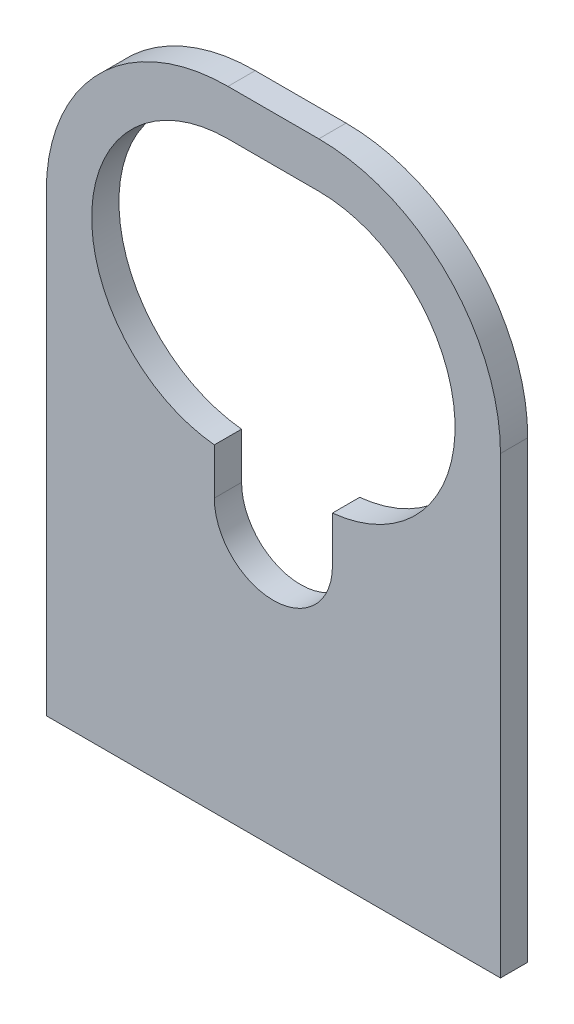
ISO-10303-21;
HEADER;
FILE_DESCRIPTION(('STEP AP214'),'2;1');
FILE_NAME('part.step','',(''),(''),'','','');
FILE_SCHEMA(('AUTOMOTIVE_DESIGN { 1 0 10303 214 1 1 1 1 }'));
ENDSEC;
DATA;
#1=APPLICATION_CONTEXT('core data for automotive mechanical design processes');
#2=APPLICATION_PROTOCOL_DEFINITION('international standard','automotive_design',2000,#1);
#3=PRODUCT_CONTEXT('',#1,'mechanical');
#4=PRODUCT('Part','Part','',(#3));
#5=PRODUCT_RELATED_PRODUCT_CATEGORY('part','',(#4));
#6=PRODUCT_DEFINITION_FORMATION('','',#4);
#7=PRODUCT_DEFINITION_CONTEXT('part definition',#1,'design');
#8=PRODUCT_DEFINITION('design','',#6,#7);
#9=PRODUCT_DEFINITION_SHAPE('','',#8);
#10=(LENGTH_UNIT() NAMED_UNIT(*) SI_UNIT(.MILLI.,.METRE.));
#11=(NAMED_UNIT(*) PLANE_ANGLE_UNIT() SI_UNIT($,.RADIAN.));
#12=(NAMED_UNIT(*) SI_UNIT($,.STERADIAN.) SOLID_ANGLE_UNIT());
#13=UNCERTAINTY_MEASURE_WITH_UNIT(LENGTH_MEASURE(1.E-05),#10,'distance_accuracy_value','');
#14=(GEOMETRIC_REPRESENTATION_CONTEXT(3) GLOBAL_UNCERTAINTY_ASSIGNED_CONTEXT((#13)) GLOBAL_UNIT_ASSIGNED_CONTEXT((#10,
#11,#12)) REPRESENTATION_CONTEXT('',''));
#15=CARTESIAN_POINT('',(0.,0.,0.));
#16=DIRECTION('',(0.,0.,1.));
#17=DIRECTION('',(1.,0.,0.));
#18=AXIS2_PLACEMENT_3D('',#15,#16,#17);
#19=CARTESIAN_POINT('',(-25.,40.,3.));
#20=DIRECTION('',(1.,0.,0.));
#21=DIRECTION('',(0.,1.,0.));
#22=AXIS2_PLACEMENT_3D('',#19,#20,#21);
#23=PLANE('',#22);
#24=DIRECTION('',(0.,-1.,0.));
#25=VECTOR('',#24,1.);
#26=CARTESIAN_POINT('',(-25.,40.,3.));
#27=LINE('',#26,#25);
#28=CARTESIAN_POINT('',(-25.,20.,3.));
#29=VERTEX_POINT('',#28);
#30=CARTESIAN_POINT('',(-25.,-30.,3.));
#31=VERTEX_POINT('',#30);
#32=EDGE_CURVE('E167',#29,#31,#27,.T.);
#33=ORIENTED_EDGE('',*,*,#32,.F.);
#34=DIRECTION('',(0.,0.,-1.));
#35=VECTOR('',#34,1.);
#36=CARTESIAN_POINT('',(-25.,20.,3.));
#37=LINE('',#36,#35);
#38=CARTESIAN_POINT('',(-25.,20.,0.));
#39=VERTEX_POINT('',#38);
#40=EDGE_CURVE('E11',#29,#39,#37,.T.);
#41=ORIENTED_EDGE('',*,*,#40,.T.);
#42=DIRECTION('',(0.,-1.,0.));
#43=VECTOR('',#42,1.);
#44=CARTESIAN_POINT('',(-25.,40.,0.));
#45=LINE('',#44,#43);
#46=CARTESIAN_POINT('',(-25.,-30.,0.));
#47=VERTEX_POINT('',#46);
#48=EDGE_CURVE('E156',#39,#47,#45,.T.);
#49=ORIENTED_EDGE('',*,*,#48,.T.);
#50=DIRECTION('',(0.,0.,-1.));
#51=VECTOR('',#50,1.);
#52=CARTESIAN_POINT('',(-25.,-30.,3.));
#53=LINE('',#52,#51);
#54=EDGE_CURVE('E212',#31,#47,#53,.T.);
#55=ORIENTED_EDGE('',*,*,#54,.F.);
#56=EDGE_LOOP('',(#33,#41,#49,#55));
#57=FACE_BOUND('',#56,.T.);
#58=ADVANCED_FACE('F35',(#57),#23,.F.);
#59=CARTESIAN_POINT('',(-25.,-30.,3.));
#60=DIRECTION('',(0.,1.,0.));
#61=DIRECTION('',(0.,0.,1.));
#62=AXIS2_PLACEMENT_3D('',#59,#60,#61);
#63=PLANE('',#62);
#64=DIRECTION('',(1.,0.,0.));
#65=VECTOR('',#64,1.);
#66=CARTESIAN_POINT('',(-25.,-30.,0.));
#67=LINE('',#66,#65);
#68=CARTESIAN_POINT('',(25.,-30.,0.));
#69=VERTEX_POINT('',#68);
#70=EDGE_CURVE('E205',#47,#69,#67,.T.);
#71=ORIENTED_EDGE('',*,*,#70,.T.);
#72=DIRECTION('',(0.,0.,-1.));
#73=VECTOR('',#72,1.);
#74=CARTESIAN_POINT('',(25.,-30.,3.));
#75=LINE('',#74,#73);
#76=CARTESIAN_POINT('',(25.,-30.,3.));
#77=VERTEX_POINT('',#76);
#78=EDGE_CURVE('E195',#77,#69,#75,.T.);
#79=ORIENTED_EDGE('',*,*,#78,.F.);
#80=DIRECTION('',(1.,0.,0.));
#81=VECTOR('',#80,1.);
#82=CARTESIAN_POINT('',(-25.,-30.,3.));
#83=LINE('',#82,#81);
#84=EDGE_CURVE('E285',#31,#77,#83,.T.);
#85=ORIENTED_EDGE('',*,*,#84,.F.);
#86=ORIENTED_EDGE('',*,*,#54,.T.);
#87=EDGE_LOOP('',(#71,#79,#85,#86));
#88=FACE_BOUND('',#87,.T.);
#89=ADVANCED_FACE('F265',(#88),#63,.F.);
#90=CARTESIAN_POINT('',(25.,40.,3.));
#91=DIRECTION('',(-1.,0.,0.));
#92=DIRECTION('',(0.,-1.,0.));
#93=AXIS2_PLACEMENT_3D('',#90,#91,#92);
#94=PLANE('',#93);
#95=DIRECTION('',(0.,1.,0.));
#96=VECTOR('',#95,1.);
#97=CARTESIAN_POINT('',(25.,40.,0.));
#98=LINE('',#97,#96);
#99=CARTESIAN_POINT('',(25.,20.,0.));
#100=VERTEX_POINT('',#99);
#101=EDGE_CURVE('E200',#69,#100,#98,.T.);
#102=ORIENTED_EDGE('',*,*,#101,.T.);
#103=DIRECTION('',(0.,0.,-1.));
#104=VECTOR('',#103,1.);
#105=CARTESIAN_POINT('',(25.,20.,3.));
#106=LINE('',#105,#104);
#107=CARTESIAN_POINT('',(25.,20.,3.));
#108=VERTEX_POINT('',#107);
#109=EDGE_CURVE('E58',#100,#108,#106,.F.);
#110=ORIENTED_EDGE('',*,*,#109,.T.);
#111=DIRECTION('',(0.,1.,0.));
#112=VECTOR('',#111,1.);
#113=CARTESIAN_POINT('',(25.,40.,3.));
#114=LINE('',#113,#112);
#115=EDGE_CURVE('E187',#77,#108,#114,.T.);
#116=ORIENTED_EDGE('',*,*,#115,.F.);
#117=ORIENTED_EDGE('',*,*,#78,.T.);
#118=EDGE_LOOP('',(#102,#110,#116,#117));
#119=FACE_BOUND('',#118,.T.);
#120=ADVANCED_FACE('F203',(#119),#94,.F.);
#121=CARTESIAN_POINT('',(-25.,40.,3.));
#122=DIRECTION('',(0.,-1.,0.));
#123=DIRECTION('',(0.,0.,-1.));
#124=AXIS2_PLACEMENT_3D('',#121,#122,#123);
#125=PLANE('',#124);
#126=DIRECTION('',(-1.,0.,0.));
#127=VECTOR('',#126,1.);
#128=CARTESIAN_POINT('',(-25.,40.,3.));
#129=LINE('',#128,#127);
#130=CARTESIAN_POINT('',(5.,40.,3.));
#131=VERTEX_POINT('',#130);
#132=CARTESIAN_POINT('',(-5.,40.,3.));
#133=VERTEX_POINT('',#132);
#134=EDGE_CURVE('E186',#131,#133,#129,.T.);
#135=ORIENTED_EDGE('',*,*,#134,.F.);
#136=DIRECTION('',(0.,0.,-1.));
#137=VECTOR('',#136,1.);
#138=CARTESIAN_POINT('',(5.,40.,3.));
#139=LINE('',#138,#137);
#140=CARTESIAN_POINT('',(5.,40.,0.));
#141=VERTEX_POINT('',#140);
#142=EDGE_CURVE('E175',#131,#141,#139,.T.);
#143=ORIENTED_EDGE('',*,*,#142,.T.);
#144=DIRECTION('',(-1.,0.,0.));
#145=VECTOR('',#144,1.);
#146=CARTESIAN_POINT('',(-25.,40.,0.));
#147=LINE('',#146,#145);
#148=CARTESIAN_POINT('',(-5.,40.,0.));
#149=VERTEX_POINT('',#148);
#150=EDGE_CURVE('E201',#141,#149,#147,.T.);
#151=ORIENTED_EDGE('',*,*,#150,.T.);
#152=DIRECTION('',(0.,0.,-1.));
#153=VECTOR('',#152,1.);
#154=CARTESIAN_POINT('',(-5.,40.,3.));
#155=LINE('',#154,#153);
#156=EDGE_CURVE('E173',#149,#133,#155,.F.);
#157=ORIENTED_EDGE('',*,*,#156,.T.);
#158=EDGE_LOOP('',(#135,#143,#151,#157));
#159=FACE_BOUND('',#158,.T.);
#160=ADVANCED_FACE('F191',(#159),#125,.F.);
#161=CARTESIAN_POINT('',(0.,0.,3.));
#162=DIRECTION('',(0.,0.,1.));
#163=DIRECTION('',(1.,0.,0.));
#164=AXIS2_PLACEMENT_3D('',#161,#162,#163);
#165=PLANE('',#164);
#166=DIRECTION('',(0.,-1.,0.));
#167=VECTOR('',#166,1.);
#168=CARTESIAN_POINT('',(-6.5,0.,3.));
#169=LINE('',#168,#167);
#170=CARTESIAN_POINT('',(-6.5,5.07518844340074,3.));
#171=VERTEX_POINT('',#170);
#172=CARTESIAN_POINT('',(-6.5,0.,3.000006));
#173=VERTEX_POINT('',#172);
#174=EDGE_CURVE('E132',#171,#173,#169,.T.);
#175=ORIENTED_EDGE('',*,*,#174,.F.);
#176=CARTESIAN_POINT('',(-5.,20.,3.));
#177=DIRECTION('',(0.,0.,1.));
#178=DIRECTION('',(1.,0.,0.));
#179=AXIS2_PLACEMENT_3D('',#176,#177,#178);
#180=CIRCLE('',#179,15.);
#181=CARTESIAN_POINT('',(-4.99999999999999,35.,3.));
#182=VERTEX_POINT('',#181);
#183=EDGE_CURVE('E154',#182,#171,#180,.T.);
#184=ORIENTED_EDGE('',*,*,#183,.F.);
#185=DIRECTION('',(1.,0.,0.));
#186=VECTOR('',#185,1.);
#187=CARTESIAN_POINT('',(-4.99999999999999,35.,3.));
#188=LINE('',#187,#186);
#189=CARTESIAN_POINT('',(5.,35.,3.));
#190=VERTEX_POINT('',#189);
#191=EDGE_CURVE('E159',#190,#182,#188,.F.);
#192=ORIENTED_EDGE('',*,*,#191,.F.);
#193=CARTESIAN_POINT('',(5.00000000000001,20.,3.));
#194=DIRECTION('',(0.,0.,1.));
#195=DIRECTION('',(1.,0.,0.));
#196=AXIS2_PLACEMENT_3D('',#193,#194,#195);
#197=CIRCLE('',#196,15.);
#198=CARTESIAN_POINT('',(6.5,5.07518844340074,3.));
#199=VERTEX_POINT('',#198);
#200=EDGE_CURVE('E216',#199,#190,#197,.T.);
#201=ORIENTED_EDGE('',*,*,#200,.F.);
#202=DIRECTION('',(0.,1.,0.));
#203=VECTOR('',#202,1.);
#204=CARTESIAN_POINT('',(6.5,0.,3.));
#205=LINE('',#204,#203);
#206=CARTESIAN_POINT('',(6.5,0.,3.000006));
#207=VERTEX_POINT('',#206);
#208=EDGE_CURVE('E229',#207,#199,#205,.T.);
#209=ORIENTED_EDGE('',*,*,#208,.F.);
#210=CARTESIAN_POINT('',(0.,0.,3.));
#211=DIRECTION('',(0.,0.,1.));
#212=DIRECTION('',(1.,0.,0.));
#213=AXIS2_PLACEMENT_3D('',#210,#211,#212);
#214=CIRCLE('',#213,6.5);
#215=EDGE_CURVE('E153',#173,#207,#214,.T.);
#216=ORIENTED_EDGE('',*,*,#215,.F.);
#217=EDGE_LOOP('',(#175,#184,#192,#201,#209,#216));
#218=FACE_BOUND('',#217,.T.);
#219=ORIENTED_EDGE('',*,*,#115,.T.);
#220=CARTESIAN_POINT('',(5.,20.,3.));
#221=DIRECTION('',(0.,0.,1.));
#222=DIRECTION('',(1.,0.,0.));
#223=AXIS2_PLACEMENT_3D('',#220,#221,#222);
#224=CIRCLE('',#223,20.);
#225=EDGE_CURVE('E43',#108,#131,#224,.T.);
#226=ORIENTED_EDGE('',*,*,#225,.T.);
#227=ORIENTED_EDGE('',*,*,#134,.T.);
#228=CARTESIAN_POINT('',(-5.00000000000001,20.,3.));
#229=DIRECTION('',(0.,0.,1.));
#230=DIRECTION('',(1.,0.,0.));
#231=AXIS2_PLACEMENT_3D('',#228,#229,#230);
#232=CIRCLE('',#231,20.);
#233=EDGE_CURVE('E50',#133,#29,#232,.T.);
#234=ORIENTED_EDGE('',*,*,#233,.T.);
#235=ORIENTED_EDGE('',*,*,#32,.T.);
#236=ORIENTED_EDGE('',*,*,#84,.T.);
#237=EDGE_LOOP('',(#219,#226,#227,#234,#235,#236));
#238=FACE_BOUND('',#237,.T.);
#239=ADVANCED_FACE('F185',(#218,#238),#165,.T.);
#240=CARTESIAN_POINT('',(0.,0.,0.));
#241=DIRECTION('',(0.,0.,1.));
#242=DIRECTION('',(1.,0.,0.));
#243=AXIS2_PLACEMENT_3D('',#240,#241,#242);
#244=PLANE('',#243);
#245=CARTESIAN_POINT('',(-5.,20.,0.));
#246=DIRECTION('',(0.,0.,1.));
#247=DIRECTION('',(1.,0.,0.));
#248=AXIS2_PLACEMENT_3D('',#245,#246,#247);
#249=CIRCLE('',#248,15.);
#250=CARTESIAN_POINT('',(-4.99999999999999,35.,0.));
#251=VERTEX_POINT('',#250);
#252=CARTESIAN_POINT('',(-6.5,5.07518844340074,0.));
#253=VERTEX_POINT('',#252);
#254=EDGE_CURVE('E149',#251,#253,#249,.T.);
#255=ORIENTED_EDGE('',*,*,#254,.T.);
#256=DIRECTION('',(0.,-1.,0.));
#257=VECTOR('',#256,1.);
#258=CARTESIAN_POINT('',(-6.5,0.,0.));
#259=LINE('',#258,#257);
#260=CARTESIAN_POINT('',(-6.5,0.,0.));
#261=VERTEX_POINT('',#260);
#262=EDGE_CURVE('E129',#253,#261,#259,.T.);
#263=ORIENTED_EDGE('',*,*,#262,.T.);
#264=CARTESIAN_POINT('',(0.,0.,0.));
#265=DIRECTION('',(0.,0.,1.));
#266=DIRECTION('',(1.,0.,0.));
#267=AXIS2_PLACEMENT_3D('',#264,#265,#266);
#268=CIRCLE('',#267,6.5);
#269=CARTESIAN_POINT('',(6.5,0.,0.));
#270=VERTEX_POINT('',#269);
#271=EDGE_CURVE('E146',#261,#270,#268,.T.);
#272=ORIENTED_EDGE('',*,*,#271,.T.);
#273=DIRECTION('',(0.,1.,0.));
#274=VECTOR('',#273,1.);
#275=CARTESIAN_POINT('',(6.5,0.,0.));
#276=LINE('',#275,#274);
#277=CARTESIAN_POINT('',(6.5,5.07518844340074,0.));
#278=VERTEX_POINT('',#277);
#279=EDGE_CURVE('E138',#270,#278,#276,.T.);
#280=ORIENTED_EDGE('',*,*,#279,.T.);
#281=CARTESIAN_POINT('',(5.00000000000001,20.,0.));
#282=DIRECTION('',(0.,0.,1.));
#283=DIRECTION('',(1.,0.,0.));
#284=AXIS2_PLACEMENT_3D('',#281,#282,#283);
#285=CIRCLE('',#284,15.);
#286=CARTESIAN_POINT('',(4.99999999999999,35.,0.));
#287=VERTEX_POINT('',#286);
#288=EDGE_CURVE('E231',#278,#287,#285,.T.);
#289=ORIENTED_EDGE('',*,*,#288,.T.);
#290=DIRECTION('',(-1.,0.,0.));
#291=VECTOR('',#290,1.);
#292=CARTESIAN_POINT('',(-4.99999999999999,35.,0.));
#293=LINE('',#292,#291);
#294=EDGE_CURVE('E240',#287,#251,#293,.T.);
#295=ORIENTED_EDGE('',*,*,#294,.T.);
#296=EDGE_LOOP('',(#255,#263,#272,#280,#289,#295));
#297=FACE_BOUND('',#296,.T.);
#298=ORIENTED_EDGE('',*,*,#150,.F.);
#299=CARTESIAN_POINT('',(5.,20.,0.));
#300=DIRECTION('',(0.,0.,1.));
#301=DIRECTION('',(1.,0.,0.));
#302=AXIS2_PLACEMENT_3D('',#299,#300,#301);
#303=CIRCLE('',#302,20.);
#304=EDGE_CURVE('E180',#141,#100,#303,.F.);
#305=ORIENTED_EDGE('',*,*,#304,.T.);
#306=ORIENTED_EDGE('',*,*,#101,.F.);
#307=ORIENTED_EDGE('',*,*,#70,.F.);
#308=ORIENTED_EDGE('',*,*,#48,.F.);
#309=CARTESIAN_POINT('',(-5.00000000000001,20.,0.));
#310=DIRECTION('',(0.,0.,1.));
#311=DIRECTION('',(1.,0.,0.));
#312=AXIS2_PLACEMENT_3D('',#309,#310,#311);
#313=CIRCLE('',#312,20.);
#314=EDGE_CURVE('E178',#39,#149,#313,.F.);
#315=ORIENTED_EDGE('',*,*,#314,.T.);
#316=EDGE_LOOP('',(#298,#305,#306,#307,#308,#315));
#317=FACE_BOUND('',#316,.T.);
#318=ADVANCED_FACE('F143',(#297,#317),#244,.F.);
#319=CARTESIAN_POINT('',(0.,0.,0.));
#320=DIRECTION('',(0.,0.,1.));
#321=DIRECTION('',(1.,0.,0.));
#322=AXIS2_PLACEMENT_3D('',#319,#320,#321);
#323=CYLINDRICAL_SURFACE('',#322,6.5);
#324=ORIENTED_EDGE('',*,*,#215,.T.);
#325=DIRECTION('',(0.,0.,1.));
#326=VECTOR('',#325,1.);
#327=CARTESIAN_POINT('',(6.5,0.,0.));
#328=LINE('',#327,#326);
#329=EDGE_CURVE('E137',#270,#207,#328,.T.);
#330=ORIENTED_EDGE('',*,*,#329,.F.);
#331=ORIENTED_EDGE('',*,*,#271,.F.);
#332=DIRECTION('',(0.,0.,1.));
#333=VECTOR('',#332,1.);
#334=CARTESIAN_POINT('',(-6.5,0.,0.));
#335=LINE('',#334,#333);
#336=EDGE_CURVE('E126',#261,#173,#335,.T.);
#337=ORIENTED_EDGE('',*,*,#336,.T.);
#338=EDGE_LOOP('',(#324,#330,#331,#337));
#339=FACE_BOUND('',#338,.T.);
#340=ADVANCED_FACE('F152',(#339),#323,.F.);
#341=CARTESIAN_POINT('',(-5.,20.,0.));
#342=DIRECTION('',(0.,0.,1.));
#343=DIRECTION('',(1.,0.,0.));
#344=AXIS2_PLACEMENT_3D('',#341,#342,#343);
#345=CYLINDRICAL_SURFACE('',#344,15.);
#346=ORIENTED_EDGE('',*,*,#183,.T.);
#347=DIRECTION('',(0.,0.,1.));
#348=VECTOR('',#347,1.);
#349=CARTESIAN_POINT('',(-6.5,5.07518844340074,0.));
#350=LINE('',#349,#348);
#351=EDGE_CURVE('E171',#171,#253,#350,.F.);
#352=ORIENTED_EDGE('',*,*,#351,.T.);
#353=ORIENTED_EDGE('',*,*,#254,.F.);
#354=DIRECTION('',(0.,0.,1.));
#355=VECTOR('',#354,1.);
#356=CARTESIAN_POINT('',(-4.99999999999999,35.,0.));
#357=LINE('',#356,#355);
#358=EDGE_CURVE('E163',#251,#182,#357,.T.);
#359=ORIENTED_EDGE('',*,*,#358,.T.);
#360=EDGE_LOOP('',(#346,#352,#353,#359));
#361=FACE_BOUND('',#360,.T.);
#362=ADVANCED_FACE('F223',(#361),#345,.F.);
#363=CARTESIAN_POINT('',(-4.99999999999999,35.,0.));
#364=DIRECTION('',(0.,1.,0.));
#365=DIRECTION('',(0.,0.,1.));
#366=AXIS2_PLACEMENT_3D('',#363,#364,#365);
#367=PLANE('',#366);
#368=ORIENTED_EDGE('',*,*,#191,.T.);
#369=ORIENTED_EDGE('',*,*,#358,.F.);
#370=ORIENTED_EDGE('',*,*,#294,.F.);
#371=DIRECTION('',(0.,0.,1.));
#372=VECTOR('',#371,1.);
#373=CARTESIAN_POINT('',(4.99999999999999,35.,0.));
#374=LINE('',#373,#372);
#375=EDGE_CURVE('E241',#287,#190,#374,.T.);
#376=ORIENTED_EDGE('',*,*,#375,.T.);
#377=EDGE_LOOP('',(#368,#369,#370,#376));
#378=FACE_BOUND('',#377,.T.);
#379=ADVANCED_FACE('F246',(#378),#367,.F.);
#380=CARTESIAN_POINT('',(5.00000000000001,20.,0.));
#381=DIRECTION('',(0.,0.,1.));
#382=DIRECTION('',(1.,0.,0.));
#383=AXIS2_PLACEMENT_3D('',#380,#381,#382);
#384=CYLINDRICAL_SURFACE('',#383,15.);
#385=ORIENTED_EDGE('',*,*,#288,.F.);
#386=DIRECTION('',(0.,0.,1.));
#387=VECTOR('',#386,1.);
#388=CARTESIAN_POINT('',(6.5,5.07518844340074,0.));
#389=LINE('',#388,#387);
#390=EDGE_CURVE('E215',#278,#199,#389,.T.);
#391=ORIENTED_EDGE('',*,*,#390,.T.);
#392=ORIENTED_EDGE('',*,*,#200,.T.);
#393=ORIENTED_EDGE('',*,*,#375,.F.);
#394=EDGE_LOOP('',(#385,#391,#392,#393));
#395=FACE_BOUND('',#394,.T.);
#396=ADVANCED_FACE('F247',(#395),#384,.F.);
#397=CARTESIAN_POINT('',(6.5,0.,0.));
#398=DIRECTION('',(1.,0.,0.));
#399=DIRECTION('',(0.,0.,-1.));
#400=AXIS2_PLACEMENT_3D('',#397,#398,#399);
#401=PLANE('',#400);
#402=ORIENTED_EDGE('',*,*,#208,.T.);
#403=ORIENTED_EDGE('',*,*,#390,.F.);
#404=ORIENTED_EDGE('',*,*,#279,.F.);
#405=ORIENTED_EDGE('',*,*,#329,.T.);
#406=EDGE_LOOP('',(#402,#403,#404,#405));
#407=FACE_BOUND('',#406,.T.);
#408=ADVANCED_FACE('F255',(#407),#401,.F.);
#409=CARTESIAN_POINT('',(-6.5,0.,0.));
#410=DIRECTION('',(-1.,0.,0.));
#411=DIRECTION('',(0.,0.,1.));
#412=AXIS2_PLACEMENT_3D('',#409,#410,#411);
#413=PLANE('',#412);
#414=ORIENTED_EDGE('',*,*,#174,.T.);
#415=ORIENTED_EDGE('',*,*,#336,.F.);
#416=ORIENTED_EDGE('',*,*,#262,.F.);
#417=ORIENTED_EDGE('',*,*,#351,.F.);
#418=EDGE_LOOP('',(#414,#415,#416,#417));
#419=FACE_BOUND('',#418,.T.);
#420=ADVANCED_FACE('F128',(#419),#413,.F.);
#421=CARTESIAN_POINT('',(5.,20.,3.));
#422=DIRECTION('',(0.,0.,-1.));
#423=DIRECTION('',(-1.,0.,0.));
#424=AXIS2_PLACEMENT_3D('',#421,#422,#423);
#425=CYLINDRICAL_SURFACE('',#424,20.);
#426=ORIENTED_EDGE('',*,*,#225,.F.);
#427=ORIENTED_EDGE('',*,*,#109,.F.);
#428=ORIENTED_EDGE('',*,*,#304,.F.);
#429=ORIENTED_EDGE('',*,*,#142,.F.);
#430=EDGE_LOOP('',(#426,#427,#428,#429));
#431=FACE_BOUND('',#430,.T.);
#432=ADVANCED_FACE('F197',(#431),#425,.T.);
#433=CARTESIAN_POINT('',(-5.00000000000001,20.,3.));
#434=DIRECTION('',(0.,0.,-1.));
#435=DIRECTION('',(-1.,0.,0.));
#436=AXIS2_PLACEMENT_3D('',#433,#434,#435);
#437=CYLINDRICAL_SURFACE('',#436,20.);
#438=ORIENTED_EDGE('',*,*,#233,.F.);
#439=ORIENTED_EDGE('',*,*,#156,.F.);
#440=ORIENTED_EDGE('',*,*,#314,.F.);
#441=ORIENTED_EDGE('',*,*,#40,.F.);
#442=EDGE_LOOP('',(#438,#439,#440,#441));
#443=FACE_BOUND('',#442,.T.);
#444=ADVANCED_FACE('F37',(#443),#437,.T.);
#445=CLOSED_SHELL('',(#58,#89,#120,#160,#239,#318,#340,#362,#379,#396,#408,#420,#432,#444));
#446=MANIFOLD_SOLID_BREP('B2',#445);
#447=ADVANCED_BREP_SHAPE_REPRESENTATION('',(#18,#446),#14);
#448=SHAPE_DEFINITION_REPRESENTATION(#9,#447);
ENDSEC;
END-ISO-10303-21;
